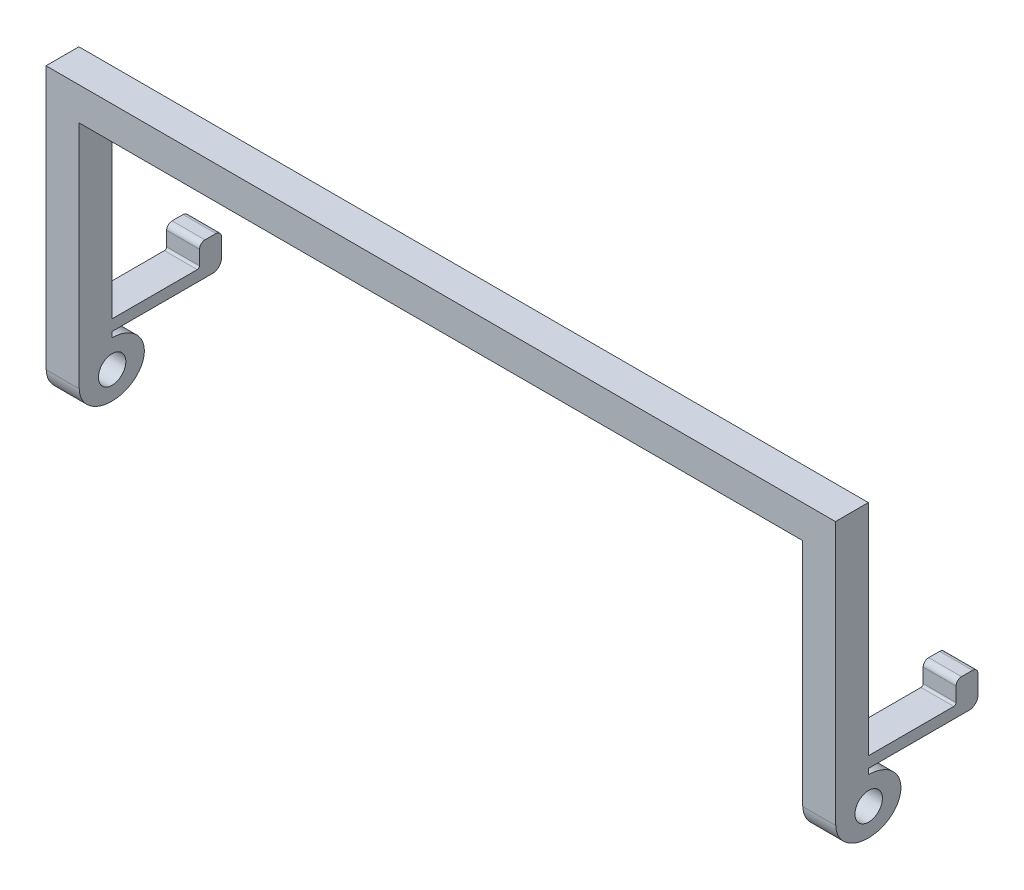
ISO-10303-21;
HEADER;
FILE_DESCRIPTION(('STEP AP214'),'2;1');
FILE_NAME('part.step','',(''),(''),'','','');
FILE_SCHEMA(('AUTOMOTIVE_DESIGN { 1 0 10303 214 1 1 1 1 }'));
ENDSEC;
DATA;
#1=APPLICATION_CONTEXT('core data for automotive mechanical design processes');
#2=APPLICATION_PROTOCOL_DEFINITION('international standard','automotive_design',2000,#1);
#3=PRODUCT_CONTEXT('',#1,'mechanical');
#4=PRODUCT('Part','Part','',(#3));
#5=PRODUCT_RELATED_PRODUCT_CATEGORY('part','',(#4));
#6=PRODUCT_DEFINITION_FORMATION('','',#4);
#7=PRODUCT_DEFINITION_CONTEXT('part definition',#1,'design');
#8=PRODUCT_DEFINITION('design','',#6,#7);
#9=PRODUCT_DEFINITION_SHAPE('','',#8);
#10=(LENGTH_UNIT() NAMED_UNIT(*) SI_UNIT(.MILLI.,.METRE.));
#11=(NAMED_UNIT(*) PLANE_ANGLE_UNIT() SI_UNIT($,.RADIAN.));
#12=(NAMED_UNIT(*) SI_UNIT($,.STERADIAN.) SOLID_ANGLE_UNIT());
#13=UNCERTAINTY_MEASURE_WITH_UNIT(LENGTH_MEASURE(1.E-05),#10,'distance_accuracy_value','');
#14=(GEOMETRIC_REPRESENTATION_CONTEXT(3) GLOBAL_UNCERTAINTY_ASSIGNED_CONTEXT((#13)) GLOBAL_UNIT_ASSIGNED_CONTEXT((#10,
#11,#12)) REPRESENTATION_CONTEXT('',''));
#15=CARTESIAN_POINT('',(0.,0.,0.));
#16=DIRECTION('',(0.,0.,1.));
#17=DIRECTION('',(1.,0.,0.));
#18=AXIS2_PLACEMENT_3D('',#15,#16,#17);
#19=CARTESIAN_POINT('',(0.,0.,3.));
#20=DIRECTION('',(0.,1.,0.));
#21=DIRECTION('',(0.,0.,1.));
#22=AXIS2_PLACEMENT_3D('',#19,#20,#21);
#23=PLANE('',#22);
#24=DIRECTION('',(0.,0.,1.));
#25=VECTOR('',#24,1.);
#26=CARTESIAN_POINT('',(-33.,0.,3.));
#27=LINE('',#26,#25);
#28=CARTESIAN_POINT('',(-33.,0.,0.));
#29=VERTEX_POINT('',#28);
#30=CARTESIAN_POINT('',(-33.,0.,3.));
#31=VERTEX_POINT('',#30);
#32=EDGE_CURVE('E51',#29,#31,#27,.T.);
#33=ORIENTED_EDGE('',*,*,#32,.F.);
#34=DIRECTION('',(1.,0.,0.));
#35=VECTOR('',#34,1.);
#36=CARTESIAN_POINT('',(0.,0.,0.));
#37=LINE('',#36,#35);
#38=CARTESIAN_POINT('',(33.,0.,0.));
#39=VERTEX_POINT('',#38);
#40=EDGE_CURVE('E251',#29,#39,#37,.T.);
#41=ORIENTED_EDGE('',*,*,#40,.T.);
#42=DIRECTION('',(0.,0.,-1.));
#43=VECTOR('',#42,1.);
#44=CARTESIAN_POINT('',(33.,0.,3.));
#45=LINE('',#44,#43);
#46=CARTESIAN_POINT('',(33.,0.,3.));
#47=VERTEX_POINT('',#46);
#48=EDGE_CURVE('E462',#47,#39,#45,.T.);
#49=ORIENTED_EDGE('',*,*,#48,.F.);
#50=DIRECTION('',(1.,0.,0.));
#51=VECTOR('',#50,1.);
#52=CARTESIAN_POINT('',(0.,0.,3.));
#53=LINE('',#52,#51);
#54=EDGE_CURVE('E47',#31,#47,#53,.T.);
#55=ORIENTED_EDGE('',*,*,#54,.F.);
#56=EDGE_LOOP('',(#33,#41,#49,#55));
#57=FACE_BOUND('',#56,.T.);
#58=ADVANCED_FACE('F32',(#57),#23,.F.);
#59=CARTESIAN_POINT('',(36.,0.,3.));
#60=DIRECTION('',(-1.,0.,0.));
#61=DIRECTION('',(0.,0.,1.));
#62=AXIS2_PLACEMENT_3D('',#59,#60,#61);
#63=PLANE('',#62);
#64=CARTESIAN_POINT('',(36.,-21.,-0.0308723752893004));
#65=DIRECTION('',(-1.,0.,0.));
#66=DIRECTION('',(0.,0.,1.));
#67=AXIS2_PLACEMENT_3D('',#64,#65,#66);
#68=CIRCLE('',#67,1.25);
#69=CARTESIAN_POINT('',(36.,-21.,1.2191276247107));
#70=VERTEX_POINT('',#69);
#71=EDGE_CURVE('E547',#70,#70,#68,.T.);
#72=ORIENTED_EDGE('',*,*,#71,.T.);
#73=EDGE_LOOP('',(#72));
#74=FACE_BOUND('',#73,.T.);
#75=DIRECTION('',(0.,1.,0.));
#76=VECTOR('',#75,1.);
#77=CARTESIAN_POINT('',(36.,0.,0.));
#78=LINE('',#77,#76);
#79=CARTESIAN_POINT('',(36.,-17.,0.));
#80=VERTEX_POINT('',#79);
#81=CARTESIAN_POINT('',(36.,3.,0.));
#82=VERTEX_POINT('',#81);
#83=EDGE_CURVE('E495',#80,#82,#78,.T.);
#84=ORIENTED_EDGE('',*,*,#83,.T.);
#85=DIRECTION('',(0.,0.,-1.));
#86=VECTOR('',#85,1.);
#87=CARTESIAN_POINT('',(36.,3.,3.));
#88=LINE('',#87,#86);
#89=CARTESIAN_POINT('',(36.,3.,3.));
#90=VERTEX_POINT('',#89);
#91=EDGE_CURVE('E11',#90,#82,#88,.T.);
#92=ORIENTED_EDGE('',*,*,#91,.F.);
#93=DIRECTION('',(0.,1.,0.));
#94=VECTOR('',#93,1.);
#95=CARTESIAN_POINT('',(36.,0.,3.));
#96=LINE('',#95,#94);
#97=CARTESIAN_POINT('',(36.,-21.,3.));
#98=VERTEX_POINT('',#97);
#99=EDGE_CURVE('E490',#98,#90,#96,.T.);
#100=ORIENTED_EDGE('',*,*,#99,.F.);
#101=DIRECTION('',(0.,0.,-1.));
#102=VECTOR('',#101,1.);
#103=CARTESIAN_POINT('',(36.,-21.,3.));
#104=LINE('',#103,#102);
#105=CARTESIAN_POINT('',(36.,-21.,2.9691276247107));
#106=VERTEX_POINT('',#105);
#107=EDGE_CURVE('E421',#98,#106,#104,.T.);
#108=ORIENTED_EDGE('',*,*,#107,.T.);
#109=CARTESIAN_POINT('',(36.,-21.,0.));
#110=DIRECTION('',(1.,0.,0.));
#111=DIRECTION('',(0.,0.,-1.));
#112=AXIS2_PLACEMENT_3D('',#109,#110,#111);
#113=ELLIPSE('',#112,2.9691276247107,2.5);
#114=CARTESIAN_POINT('',(36.,-18.5,0.));
#115=VERTEX_POINT('',#114);
#116=EDGE_CURVE('E424',#106,#115,#113,.T.);
#117=ORIENTED_EDGE('',*,*,#116,.T.);
#118=DIRECTION('',(0.,1.,0.));
#119=VECTOR('',#118,1.);
#120=CARTESIAN_POINT('',(36.,-18.,0.));
#121=LINE('',#120,#119);
#122=CARTESIAN_POINT('',(36.,-18.,0.));
#123=VERTEX_POINT('',#122);
#124=EDGE_CURVE('E428',#115,#123,#121,.T.);
#125=ORIENTED_EDGE('',*,*,#124,.T.);
#126=DIRECTION('',(0.,0.,-1.));
#127=VECTOR('',#126,1.);
#128=CARTESIAN_POINT('',(36.,-18.,-9.2));
#129=LINE('',#128,#127);
#130=CARTESIAN_POINT('',(36.,-18.,-9.2));
#131=VERTEX_POINT('',#130);
#132=EDGE_CURVE('E431',#123,#131,#129,.T.);
#133=ORIENTED_EDGE('',*,*,#132,.T.);
#134=CARTESIAN_POINT('',(36.,-17.2,-9.2));
#135=DIRECTION('',(1.,0.,0.));
#136=DIRECTION('',(0.,0.,-1.));
#137=AXIS2_PLACEMENT_3D('',#134,#135,#136);
#138=CIRCLE('',#137,0.799999999999999);
#139=CARTESIAN_POINT('',(36.,-17.2,-10.));
#140=VERTEX_POINT('',#139);
#141=EDGE_CURVE('E434',#131,#140,#138,.T.);
#142=ORIENTED_EDGE('',*,*,#141,.T.);
#143=DIRECTION('',(0.,1.,0.));
#144=VECTOR('',#143,1.);
#145=CARTESIAN_POINT('',(36.,-15.5,-10.));
#146=LINE('',#145,#144);
#147=CARTESIAN_POINT('',(36.,-15.5,-10.));
#148=VERTEX_POINT('',#147);
#149=EDGE_CURVE('E437',#140,#148,#146,.T.);
#150=ORIENTED_EDGE('',*,*,#149,.T.);
#151=CARTESIAN_POINT('',(36.,-15.5,-9.5));
#152=DIRECTION('',(1.,0.,0.));
#153=DIRECTION('',(0.,0.,1.));
#154=AXIS2_PLACEMENT_3D('',#151,#152,#153);
#155=CIRCLE('',#154,0.5);
#156=CARTESIAN_POINT('',(36.,-15.,-9.5));
#157=VERTEX_POINT('',#156);
#158=EDGE_CURVE('E440',#148,#157,#155,.T.);
#159=ORIENTED_EDGE('',*,*,#158,.T.);
#160=DIRECTION('',(0.,0.,1.));
#161=VECTOR('',#160,1.);
#162=CARTESIAN_POINT('',(36.,-15.,-8.5));
#163=LINE('',#162,#161);
#164=CARTESIAN_POINT('',(36.,-15.,-8.5));
#165=VERTEX_POINT('',#164);
#166=EDGE_CURVE('E443',#157,#165,#163,.T.);
#167=ORIENTED_EDGE('',*,*,#166,.T.);
#168=CARTESIAN_POINT('',(36.,-15.5,-8.5));
#169=DIRECTION('',(1.,0.,0.));
#170=DIRECTION('',(0.,0.,1.));
#171=AXIS2_PLACEMENT_3D('',#168,#169,#170);
#172=CIRCLE('',#171,0.5);
#173=CARTESIAN_POINT('',(36.,-15.5,-8.));
#174=VERTEX_POINT('',#173);
#175=EDGE_CURVE('E446',#165,#174,#172,.T.);
#176=ORIENTED_EDGE('',*,*,#175,.T.);
#177=DIRECTION('',(0.,-1.,0.));
#178=VECTOR('',#177,1.);
#179=CARTESIAN_POINT('',(36.,-16.8,-8.));
#180=LINE('',#179,#178);
#181=CARTESIAN_POINT('',(36.,-16.8,-8.));
#182=VERTEX_POINT('',#181);
#183=EDGE_CURVE('E449',#174,#182,#180,.T.);
#184=ORIENTED_EDGE('',*,*,#183,.T.);
#185=CARTESIAN_POINT('',(36.,-16.8,-7.8));
#186=DIRECTION('',(-1.,0.,0.));
#187=DIRECTION('',(0.,0.,-1.));
#188=AXIS2_PLACEMENT_3D('',#185,#186,#187);
#189=CIRCLE('',#188,0.199999999999999);
#190=CARTESIAN_POINT('',(36.,-17.,-7.8));
#191=VERTEX_POINT('',#190);
#192=EDGE_CURVE('E452',#182,#191,#189,.T.);
#193=ORIENTED_EDGE('',*,*,#192,.T.);
#194=DIRECTION('',(0.,0.,1.));
#195=VECTOR('',#194,1.);
#196=CARTESIAN_POINT('',(36.,-17.,0.));
#197=LINE('',#196,#195);
#198=EDGE_CURVE('E455',#191,#80,#197,.T.);
#199=ORIENTED_EDGE('',*,*,#198,.T.);
#200=EDGE_LOOP('',(#84,#92,#100,#108,#117,#125,#133,#142,#150,#159,#167,#176,#184,#193,#199));
#201=FACE_BOUND('',#200,.T.);
#202=ADVANCED_FACE('F528',(#74,#201),#63,.F.);
#203=CARTESIAN_POINT('',(0.,3.,3.));
#204=DIRECTION('',(0.,-1.,0.));
#205=DIRECTION('',(1.,0.,0.));
#206=AXIS2_PLACEMENT_3D('',#203,#204,#205);
#207=PLANE('',#206);
#208=DIRECTION('',(0.,0.,-1.));
#209=VECTOR('',#208,1.);
#210=CARTESIAN_POINT('',(-36.,3.,3.));
#211=LINE('',#210,#209);
#212=CARTESIAN_POINT('',(-36.,3.,3.));
#213=VERTEX_POINT('',#212);
#214=CARTESIAN_POINT('',(-36.,3.,0.));
#215=VERTEX_POINT('',#214);
#216=EDGE_CURVE('E425',#213,#215,#211,.T.);
#217=ORIENTED_EDGE('',*,*,#216,.F.);
#218=DIRECTION('',(-1.,0.,0.));
#219=VECTOR('',#218,1.);
#220=CARTESIAN_POINT('',(0.,3.,3.));
#221=LINE('',#220,#219);
#222=EDGE_CURVE('E40',#90,#213,#221,.T.);
#223=ORIENTED_EDGE('',*,*,#222,.F.);
#224=ORIENTED_EDGE('',*,*,#91,.T.);
#225=DIRECTION('',(-1.,0.,0.));
#226=VECTOR('',#225,1.);
#227=CARTESIAN_POINT('',(0.,3.,0.));
#228=LINE('',#227,#226);
#229=EDGE_CURVE('E491',#82,#215,#228,.T.);
#230=ORIENTED_EDGE('',*,*,#229,.T.);
#231=EDGE_LOOP('',(#217,#223,#224,#230));
#232=FACE_BOUND('',#231,.T.);
#233=ADVANCED_FACE('F501',(#232),#207,.F.);
#234=CARTESIAN_POINT('',(0.,0.,3.));
#235=DIRECTION('',(0.,0.,-1.));
#236=DIRECTION('',(-1.,0.,0.));
#237=AXIS2_PLACEMENT_3D('',#234,#235,#236);
#238=PLANE('',#237);
#239=DIRECTION('',(0.,1.,0.));
#240=VECTOR('',#239,1.);
#241=CARTESIAN_POINT('',(-36.,0.,3.));
#242=LINE('',#241,#240);
#243=CARTESIAN_POINT('',(-36.,-21.,3.));
#244=VERTEX_POINT('',#243);
#245=EDGE_CURVE('E508',#244,#213,#242,.T.);
#246=ORIENTED_EDGE('',*,*,#245,.F.);
#247=DIRECTION('',(-1.,0.,0.));
#248=VECTOR('',#247,1.);
#249=CARTESIAN_POINT('',(-33.,-21.,3.));
#250=LINE('',#249,#248);
#251=CARTESIAN_POINT('',(-33.,-21.,3.));
#252=VERTEX_POINT('',#251);
#253=EDGE_CURVE('E512',#252,#244,#250,.T.);
#254=ORIENTED_EDGE('',*,*,#253,.F.);
#255=DIRECTION('',(0.,-1.,0.));
#256=VECTOR('',#255,1.);
#257=CARTESIAN_POINT('',(-33.,3.,3.));
#258=LINE('',#257,#256);
#259=EDGE_CURVE('E252',#31,#252,#258,.T.);
#260=ORIENTED_EDGE('',*,*,#259,.F.);
#261=ORIENTED_EDGE('',*,*,#54,.T.);
#262=DIRECTION('',(0.,-1.,0.));
#263=VECTOR('',#262,1.);
#264=CARTESIAN_POINT('',(33.,3.,3.));
#265=LINE('',#264,#263);
#266=CARTESIAN_POINT('',(33.,-21.,3.));
#267=VERTEX_POINT('',#266);
#268=EDGE_CURVE('E458',#47,#267,#265,.T.);
#269=ORIENTED_EDGE('',*,*,#268,.T.);
#270=DIRECTION('',(1.,0.,0.));
#271=VECTOR('',#270,1.);
#272=CARTESIAN_POINT('',(33.,-21.,3.));
#273=LINE('',#272,#271);
#274=EDGE_CURVE('E420',#267,#98,#273,.T.);
#275=ORIENTED_EDGE('',*,*,#274,.T.);
#276=ORIENTED_EDGE('',*,*,#99,.T.);
#277=ORIENTED_EDGE('',*,*,#222,.T.);
#278=EDGE_LOOP('',(#246,#254,#260,#261,#269,#275,#276,#277));
#279=FACE_BOUND('',#278,.T.);
#280=ADVANCED_FACE('F529',(#279),#238,.F.);
#281=CARTESIAN_POINT('',(0.,0.,0.));
#282=DIRECTION('',(0.,0.,-1.));
#283=DIRECTION('',(-1.,0.,0.));
#284=AXIS2_PLACEMENT_3D('',#281,#282,#283);
#285=PLANE('',#284);
#286=DIRECTION('',(0.,1.,0.));
#287=VECTOR('',#286,1.);
#288=CARTESIAN_POINT('',(-36.,0.,0.));
#289=LINE('',#288,#287);
#290=CARTESIAN_POINT('',(-36.,-17.,0.));
#291=VERTEX_POINT('',#290);
#292=EDGE_CURVE('E506',#291,#215,#289,.T.);
#293=ORIENTED_EDGE('',*,*,#292,.T.);
#294=ORIENTED_EDGE('',*,*,#229,.F.);
#295=ORIENTED_EDGE('',*,*,#83,.F.);
#296=DIRECTION('',(1.,0.,0.));
#297=VECTOR('',#296,1.);
#298=CARTESIAN_POINT('',(33.,-17.,0.));
#299=LINE('',#298,#297);
#300=CARTESIAN_POINT('',(33.,-17.,0.));
#301=VERTEX_POINT('',#300);
#302=EDGE_CURVE('E459',#301,#80,#299,.T.);
#303=ORIENTED_EDGE('',*,*,#302,.F.);
#304=DIRECTION('',(0.,1.,0.));
#305=VECTOR('',#304,1.);
#306=CARTESIAN_POINT('',(33.,3.,0.));
#307=LINE('',#306,#305);
#308=EDGE_CURVE('E418',#301,#39,#307,.T.);
#309=ORIENTED_EDGE('',*,*,#308,.T.);
#310=ORIENTED_EDGE('',*,*,#40,.F.);
#311=DIRECTION('',(0.,1.,0.));
#312=VECTOR('',#311,1.);
#313=CARTESIAN_POINT('',(-33.,3.,0.));
#314=LINE('',#313,#312);
#315=CARTESIAN_POINT('',(-33.,-17.,0.));
#316=VERTEX_POINT('',#315);
#317=EDGE_CURVE('E231',#316,#29,#314,.T.);
#318=ORIENTED_EDGE('',*,*,#317,.F.);
#319=DIRECTION('',(-1.,0.,0.));
#320=VECTOR('',#319,1.);
#321=CARTESIAN_POINT('',(-33.,-17.,0.));
#322=LINE('',#321,#320);
#323=EDGE_CURVE('E240',#316,#291,#322,.T.);
#324=ORIENTED_EDGE('',*,*,#323,.T.);
#325=EDGE_LOOP('',(#293,#294,#295,#303,#309,#310,#318,#324));
#326=FACE_BOUND('',#325,.T.);
#327=ADVANCED_FACE('F249',(#326),#285,.T.);
#328=CARTESIAN_POINT('',(33.,-21.,0.));
#329=DIRECTION('',(1.,0.,0.));
#330=DIRECTION('',(0.,0.,-1.));
#331=AXIS2_PLACEMENT_3D('',#328,#329,#330);
#332=PLANE('',#331);
#333=CARTESIAN_POINT('',(33.,-21.,-0.0308723752893004));
#334=DIRECTION('',(1.,0.,0.));
#335=DIRECTION('',(0.,0.,-1.));
#336=AXIS2_PLACEMENT_3D('',#333,#334,#335);
#337=CIRCLE('',#336,1.25);
#338=CARTESIAN_POINT('',(33.,-21.,-1.2808723752893));
#339=VERTEX_POINT('',#338);
#340=EDGE_CURVE('E549',#339,#339,#337,.T.);
#341=ORIENTED_EDGE('',*,*,#340,.T.);
#342=EDGE_LOOP('',(#341));
#343=FACE_BOUND('',#342,.T.);
#344=ORIENTED_EDGE('',*,*,#268,.F.);
#345=ORIENTED_EDGE('',*,*,#48,.T.);
#346=ORIENTED_EDGE('',*,*,#308,.F.);
#347=DIRECTION('',(0.,0.,1.));
#348=VECTOR('',#347,1.);
#349=CARTESIAN_POINT('',(33.,-17.,0.));
#350=LINE('',#349,#348);
#351=CARTESIAN_POINT('',(33.,-17.,-7.8));
#352=VERTEX_POINT('',#351);
#353=EDGE_CURVE('E415',#352,#301,#350,.T.);
#354=ORIENTED_EDGE('',*,*,#353,.F.);
#355=CARTESIAN_POINT('',(33.,-16.8,-7.8));
#356=DIRECTION('',(-1.,0.,0.));
#357=DIRECTION('',(0.,0.,-1.));
#358=AXIS2_PLACEMENT_3D('',#355,#356,#357);
#359=CIRCLE('',#358,0.199999999999999);
#360=CARTESIAN_POINT('',(33.,-16.8,-8.));
#361=VERTEX_POINT('',#360);
#362=EDGE_CURVE('E412',#361,#352,#359,.T.);
#363=ORIENTED_EDGE('',*,*,#362,.F.);
#364=DIRECTION('',(0.,-1.,0.));
#365=VECTOR('',#364,1.);
#366=CARTESIAN_POINT('',(33.,-16.8,-8.));
#367=LINE('',#366,#365);
#368=CARTESIAN_POINT('',(33.,-15.5,-8.));
#369=VERTEX_POINT('',#368);
#370=EDGE_CURVE('E409',#369,#361,#367,.T.);
#371=ORIENTED_EDGE('',*,*,#370,.F.);
#372=CARTESIAN_POINT('',(33.,-15.5,-8.5));
#373=DIRECTION('',(1.,0.,0.));
#374=DIRECTION('',(0.,0.,1.));
#375=AXIS2_PLACEMENT_3D('',#372,#373,#374);
#376=CIRCLE('',#375,0.5);
#377=CARTESIAN_POINT('',(33.,-15.,-8.5));
#378=VERTEX_POINT('',#377);
#379=EDGE_CURVE('E406',#378,#369,#376,.T.);
#380=ORIENTED_EDGE('',*,*,#379,.F.);
#381=DIRECTION('',(0.,0.,1.));
#382=VECTOR('',#381,1.);
#383=CARTESIAN_POINT('',(33.,-15.,-8.5));
#384=LINE('',#383,#382);
#385=CARTESIAN_POINT('',(33.,-15.,-9.5));
#386=VERTEX_POINT('',#385);
#387=EDGE_CURVE('E403',#386,#378,#384,.T.);
#388=ORIENTED_EDGE('',*,*,#387,.F.);
#389=CARTESIAN_POINT('',(33.,-15.5,-9.5));
#390=DIRECTION('',(1.,0.,0.));
#391=DIRECTION('',(0.,0.,1.));
#392=AXIS2_PLACEMENT_3D('',#389,#390,#391);
#393=CIRCLE('',#392,0.5);
#394=CARTESIAN_POINT('',(33.,-15.5,-10.));
#395=VERTEX_POINT('',#394);
#396=EDGE_CURVE('E400',#395,#386,#393,.T.);
#397=ORIENTED_EDGE('',*,*,#396,.F.);
#398=DIRECTION('',(0.,1.,0.));
#399=VECTOR('',#398,1.);
#400=CARTESIAN_POINT('',(33.,-15.5,-10.));
#401=LINE('',#400,#399);
#402=CARTESIAN_POINT('',(33.,-17.2,-10.));
#403=VERTEX_POINT('',#402);
#404=EDGE_CURVE('E397',#403,#395,#401,.T.);
#405=ORIENTED_EDGE('',*,*,#404,.F.);
#406=CARTESIAN_POINT('',(33.,-17.2,-9.2));
#407=DIRECTION('',(1.,0.,0.));
#408=DIRECTION('',(0.,0.,-1.));
#409=AXIS2_PLACEMENT_3D('',#406,#407,#408);
#410=CIRCLE('',#409,0.799999999999999);
#411=CARTESIAN_POINT('',(33.,-18.,-9.2));
#412=VERTEX_POINT('',#411);
#413=EDGE_CURVE('E394',#412,#403,#410,.T.);
#414=ORIENTED_EDGE('',*,*,#413,.F.);
#415=DIRECTION('',(0.,0.,-1.));
#416=VECTOR('',#415,1.);
#417=CARTESIAN_POINT('',(33.,-18.,-9.2));
#418=LINE('',#417,#416);
#419=CARTESIAN_POINT('',(33.,-18.,0.));
#420=VERTEX_POINT('',#419);
#421=EDGE_CURVE('E391',#420,#412,#418,.T.);
#422=ORIENTED_EDGE('',*,*,#421,.F.);
#423=DIRECTION('',(0.,1.,0.));
#424=VECTOR('',#423,1.);
#425=CARTESIAN_POINT('',(33.,-18.,0.));
#426=LINE('',#425,#424);
#427=CARTESIAN_POINT('',(33.,-18.5,0.));
#428=VERTEX_POINT('',#427);
#429=EDGE_CURVE('E386',#428,#420,#426,.T.);
#430=ORIENTED_EDGE('',*,*,#429,.F.);
#431=CARTESIAN_POINT('',(33.,-21.,0.));
#432=DIRECTION('',(1.,0.,0.));
#433=DIRECTION('',(0.,0.,-1.));
#434=AXIS2_PLACEMENT_3D('',#431,#432,#433);
#435=ELLIPSE('',#434,2.9691276247107,2.5);
#436=CARTESIAN_POINT('',(33.,-21.,2.9691276247107));
#437=VERTEX_POINT('',#436);
#438=EDGE_CURVE('E381',#437,#428,#435,.T.);
#439=ORIENTED_EDGE('',*,*,#438,.F.);
#440=DIRECTION('',(0.,0.,-1.));
#441=VECTOR('',#440,1.);
#442=CARTESIAN_POINT('',(33.,-21.,3.));
#443=LINE('',#442,#441);
#444=EDGE_CURVE('E387',#267,#437,#443,.T.);
#445=ORIENTED_EDGE('',*,*,#444,.F.);
#446=EDGE_LOOP('',(#344,#345,#346,#354,#363,#371,#380,#388,#397,#405,#414,#422,#430,#439,#445));
#447=FACE_BOUND('',#446,.T.);
#448=ADVANCED_FACE('F331',(#343,#447),#332,.F.);
#449=CARTESIAN_POINT('',(33.,-17.,0.));
#450=DIRECTION('',(0.,1.,0.));
#451=DIRECTION('',(0.,0.,1.));
#452=AXIS2_PLACEMENT_3D('',#449,#450,#451);
#453=PLANE('',#452);
#454=ORIENTED_EDGE('',*,*,#198,.F.);
#455=DIRECTION('',(1.,0.,0.));
#456=VECTOR('',#455,1.);
#457=CARTESIAN_POINT('',(33.,-17.,-7.8));
#458=LINE('',#457,#456);
#459=EDGE_CURVE('E463',#352,#191,#458,.T.);
#460=ORIENTED_EDGE('',*,*,#459,.F.);
#461=ORIENTED_EDGE('',*,*,#353,.T.);
#462=ORIENTED_EDGE('',*,*,#302,.T.);
#463=EDGE_LOOP('',(#454,#460,#461,#462));
#464=FACE_BOUND('',#463,.T.);
#465=ADVANCED_FACE('F334',(#464),#453,.T.);
#466=CARTESIAN_POINT('',(33.,-16.8,-7.8));
#467=DIRECTION('',(1.,0.,0.));
#468=DIRECTION('',(0.,0.,-1.));
#469=AXIS2_PLACEMENT_3D('',#466,#467,#468);
#470=CYLINDRICAL_SURFACE('',#469,0.199999999999999);
#471=ORIENTED_EDGE('',*,*,#192,.F.);
#472=DIRECTION('',(1.,0.,0.));
#473=VECTOR('',#472,1.);
#474=CARTESIAN_POINT('',(33.,-16.8,-8.));
#475=LINE('',#474,#473);
#476=EDGE_CURVE('E465',#361,#182,#475,.T.);
#477=ORIENTED_EDGE('',*,*,#476,.F.);
#478=ORIENTED_EDGE('',*,*,#362,.T.);
#479=ORIENTED_EDGE('',*,*,#459,.T.);
#480=EDGE_LOOP('',(#471,#477,#478,#479));
#481=FACE_BOUND('',#480,.T.);
#482=ADVANCED_FACE('F338',(#481),#470,.F.);
#483=CARTESIAN_POINT('',(33.,-16.8,-8.));
#484=DIRECTION('',(0.,0.,1.));
#485=DIRECTION('',(1.,0.,0.));
#486=AXIS2_PLACEMENT_3D('',#483,#484,#485);
#487=PLANE('',#486);
#488=ORIENTED_EDGE('',*,*,#183,.F.);
#489=DIRECTION('',(1.,0.,0.));
#490=VECTOR('',#489,1.);
#491=CARTESIAN_POINT('',(33.,-15.5,-8.));
#492=LINE('',#491,#490);
#493=EDGE_CURVE('E467',#369,#174,#492,.T.);
#494=ORIENTED_EDGE('',*,*,#493,.F.);
#495=ORIENTED_EDGE('',*,*,#370,.T.);
#496=ORIENTED_EDGE('',*,*,#476,.T.);
#497=EDGE_LOOP('',(#488,#494,#495,#496));
#498=FACE_BOUND('',#497,.T.);
#499=ADVANCED_FACE('F342',(#498),#487,.T.);
#500=CARTESIAN_POINT('',(33.,-15.5,-8.5));
#501=DIRECTION('',(1.,0.,0.));
#502=DIRECTION('',(0.,0.,-1.));
#503=AXIS2_PLACEMENT_3D('',#500,#501,#502);
#504=CYLINDRICAL_SURFACE('',#503,0.5);
#505=ORIENTED_EDGE('',*,*,#175,.F.);
#506=DIRECTION('',(1.,0.,0.));
#507=VECTOR('',#506,1.);
#508=CARTESIAN_POINT('',(33.,-15.,-8.5));
#509=LINE('',#508,#507);
#510=EDGE_CURVE('E469',#378,#165,#509,.T.);
#511=ORIENTED_EDGE('',*,*,#510,.F.);
#512=ORIENTED_EDGE('',*,*,#379,.T.);
#513=ORIENTED_EDGE('',*,*,#493,.T.);
#514=EDGE_LOOP('',(#505,#511,#512,#513));
#515=FACE_BOUND('',#514,.T.);
#516=ADVANCED_FACE('F346',(#515),#504,.T.);
#517=CARTESIAN_POINT('',(33.,-15.,-8.5));
#518=DIRECTION('',(0.,1.,0.));
#519=DIRECTION('',(0.,0.,1.));
#520=AXIS2_PLACEMENT_3D('',#517,#518,#519);
#521=PLANE('',#520);
#522=ORIENTED_EDGE('',*,*,#166,.F.);
#523=DIRECTION('',(1.,0.,0.));
#524=VECTOR('',#523,1.);
#525=CARTESIAN_POINT('',(33.,-15.,-9.5));
#526=LINE('',#525,#524);
#527=EDGE_CURVE('E471',#386,#157,#526,.T.);
#528=ORIENTED_EDGE('',*,*,#527,.F.);
#529=ORIENTED_EDGE('',*,*,#387,.T.);
#530=ORIENTED_EDGE('',*,*,#510,.T.);
#531=EDGE_LOOP('',(#522,#528,#529,#530));
#532=FACE_BOUND('',#531,.T.);
#533=ADVANCED_FACE('F350',(#532),#521,.T.);
#534=CARTESIAN_POINT('',(33.,-15.5,-9.5));
#535=DIRECTION('',(1.,0.,0.));
#536=DIRECTION('',(0.,0.,-1.));
#537=AXIS2_PLACEMENT_3D('',#534,#535,#536);
#538=CYLINDRICAL_SURFACE('',#537,0.5);
#539=ORIENTED_EDGE('',*,*,#158,.F.);
#540=DIRECTION('',(1.,0.,0.));
#541=VECTOR('',#540,1.);
#542=CARTESIAN_POINT('',(33.,-15.5,-10.));
#543=LINE('',#542,#541);
#544=EDGE_CURVE('E473',#395,#148,#543,.T.);
#545=ORIENTED_EDGE('',*,*,#544,.F.);
#546=ORIENTED_EDGE('',*,*,#396,.T.);
#547=ORIENTED_EDGE('',*,*,#527,.T.);
#548=EDGE_LOOP('',(#539,#545,#546,#547));
#549=FACE_BOUND('',#548,.T.);
#550=ADVANCED_FACE('F354',(#549),#538,.T.);
#551=CARTESIAN_POINT('',(33.,-15.5,-10.));
#552=DIRECTION('',(0.,0.,-1.));
#553=DIRECTION('',(-1.,0.,0.));
#554=AXIS2_PLACEMENT_3D('',#551,#552,#553);
#555=PLANE('',#554);
#556=ORIENTED_EDGE('',*,*,#149,.F.);
#557=DIRECTION('',(1.,0.,0.));
#558=VECTOR('',#557,1.);
#559=CARTESIAN_POINT('',(33.,-17.2,-10.));
#560=LINE('',#559,#558);
#561=EDGE_CURVE('E475',#403,#140,#560,.T.);
#562=ORIENTED_EDGE('',*,*,#561,.F.);
#563=ORIENTED_EDGE('',*,*,#404,.T.);
#564=ORIENTED_EDGE('',*,*,#544,.T.);
#565=EDGE_LOOP('',(#556,#562,#563,#564));
#566=FACE_BOUND('',#565,.T.);
#567=ADVANCED_FACE('F358',(#566),#555,.T.);
#568=CARTESIAN_POINT('',(33.,-17.2,-9.2));
#569=DIRECTION('',(1.,0.,0.));
#570=DIRECTION('',(0.,0.,-1.));
#571=AXIS2_PLACEMENT_3D('',#568,#569,#570);
#572=CYLINDRICAL_SURFACE('',#571,0.799999999999999);
#573=ORIENTED_EDGE('',*,*,#141,.F.);
#574=DIRECTION('',(1.,0.,0.));
#575=VECTOR('',#574,1.);
#576=CARTESIAN_POINT('',(33.,-18.,-9.2));
#577=LINE('',#576,#575);
#578=EDGE_CURVE('E477',#412,#131,#577,.T.);
#579=ORIENTED_EDGE('',*,*,#578,.F.);
#580=ORIENTED_EDGE('',*,*,#413,.T.);
#581=ORIENTED_EDGE('',*,*,#561,.T.);
#582=EDGE_LOOP('',(#573,#579,#580,#581));
#583=FACE_BOUND('',#582,.T.);
#584=ADVANCED_FACE('F362',(#583),#572,.T.);
#585=CARTESIAN_POINT('',(33.,-18.,-9.2));
#586=DIRECTION('',(0.,-1.,0.));
#587=DIRECTION('',(0.,0.,-1.));
#588=AXIS2_PLACEMENT_3D('',#585,#586,#587);
#589=PLANE('',#588);
#590=ORIENTED_EDGE('',*,*,#132,.F.);
#591=DIRECTION('',(1.,0.,0.));
#592=VECTOR('',#591,1.);
#593=CARTESIAN_POINT('',(33.,-18.,0.));
#594=LINE('',#593,#592);
#595=EDGE_CURVE('E479',#420,#123,#594,.T.);
#596=ORIENTED_EDGE('',*,*,#595,.F.);
#597=ORIENTED_EDGE('',*,*,#421,.T.);
#598=ORIENTED_EDGE('',*,*,#578,.T.);
#599=EDGE_LOOP('',(#590,#596,#597,#598));
#600=FACE_BOUND('',#599,.T.);
#601=ADVANCED_FACE('F366',(#600),#589,.T.);
#602=CARTESIAN_POINT('',(33.,-18.,0.));
#603=DIRECTION('',(0.,0.,-1.));
#604=DIRECTION('',(0.,1.,0.));
#605=AXIS2_PLACEMENT_3D('',#602,#603,#604);
#606=PLANE('',#605);
#607=ORIENTED_EDGE('',*,*,#124,.F.);
#608=DIRECTION('',(1.,0.,0.));
#609=VECTOR('',#608,1.);
#610=CARTESIAN_POINT('',(33.,-18.5,0.));
#611=LINE('',#610,#609);
#612=EDGE_CURVE('E481',#428,#115,#611,.T.);
#613=ORIENTED_EDGE('',*,*,#612,.F.);
#614=ORIENTED_EDGE('',*,*,#429,.T.);
#615=ORIENTED_EDGE('',*,*,#595,.T.);
#616=EDGE_LOOP('',(#607,#613,#614,#615));
#617=FACE_BOUND('',#616,.T.);
#618=ADVANCED_FACE('F370',(#617),#606,.T.);
#619=DIRECTION('',(1.,0.,0.));
#620=VECTOR('',#619,1.);
#621=SURFACE_OF_LINEAR_EXTRUSION('',#435,#620);
#622=ORIENTED_EDGE('',*,*,#116,.F.);
#623=DIRECTION('',(1.,0.,0.));
#624=VECTOR('',#623,1.);
#625=CARTESIAN_POINT('',(33.,-21.,2.9691276247107));
#626=LINE('',#625,#624);
#627=EDGE_CURVE('E483',#437,#106,#626,.T.);
#628=ORIENTED_EDGE('',*,*,#627,.F.);
#629=ORIENTED_EDGE('',*,*,#438,.T.);
#630=ORIENTED_EDGE('',*,*,#612,.T.);
#631=EDGE_LOOP('',(#622,#628,#629,#630));
#632=FACE_BOUND('',#631,.T.);
#633=ADVANCED_FACE('F374',(#632),#621,.T.);
#634=CARTESIAN_POINT('',(33.,-21.,3.));
#635=DIRECTION('',(0.,-1.,0.));
#636=DIRECTION('',(0.,0.,-1.));
#637=AXIS2_PLACEMENT_3D('',#634,#635,#636);
#638=PLANE('',#637);
#639=ORIENTED_EDGE('',*,*,#107,.F.);
#640=ORIENTED_EDGE('',*,*,#274,.F.);
#641=ORIENTED_EDGE('',*,*,#444,.T.);
#642=ORIENTED_EDGE('',*,*,#627,.T.);
#643=EDGE_LOOP('',(#639,#640,#641,#642));
#644=FACE_BOUND('',#643,.T.);
#645=ADVANCED_FACE('F329',(#644),#638,.T.);
#646=CARTESIAN_POINT('',(-36.,0.,3.));
#647=DIRECTION('',(-1.,0.,0.));
#648=DIRECTION('',(0.,0.,1.));
#649=AXIS2_PLACEMENT_3D('',#646,#647,#648);
#650=PLANE('',#649);
#651=CARTESIAN_POINT('',(-36.,-21.,-0.0308723752893004));
#652=DIRECTION('',(1.,0.,0.));
#653=DIRECTION('',(0.,0.,-1.));
#654=AXIS2_PLACEMENT_3D('',#651,#652,#653);
#655=CIRCLE('',#654,1.25);
#656=CARTESIAN_POINT('',(-36.,-21.,-1.2808723752893));
#657=VERTEX_POINT('',#656);
#658=EDGE_CURVE('E554',#657,#657,#655,.T.);
#659=ORIENTED_EDGE('',*,*,#658,.T.);
#660=EDGE_LOOP('',(#659));
#661=FACE_BOUND('',#660,.T.);
#662=ORIENTED_EDGE('',*,*,#292,.F.);
#663=DIRECTION('',(0.,0.,1.));
#664=VECTOR('',#663,1.);
#665=CARTESIAN_POINT('',(-36.,-17.,0.));
#666=LINE('',#665,#664);
#667=CARTESIAN_POINT('',(-36.,-17.,-7.8));
#668=VERTEX_POINT('',#667);
#669=EDGE_CURVE('E243',#668,#291,#666,.T.);
#670=ORIENTED_EDGE('',*,*,#669,.F.);
#671=CARTESIAN_POINT('',(-36.,-16.8,-7.8));
#672=DIRECTION('',(-1.,0.,0.));
#673=DIRECTION('',(0.,0.,-1.));
#674=AXIS2_PLACEMENT_3D('',#671,#672,#673);
#675=CIRCLE('',#674,0.199999999999999);
#676=CARTESIAN_POINT('',(-36.,-16.8,-8.));
#677=VERTEX_POINT('',#676);
#678=EDGE_CURVE('E550',#677,#668,#675,.T.);
#679=ORIENTED_EDGE('',*,*,#678,.F.);
#680=DIRECTION('',(0.,-1.,0.));
#681=VECTOR('',#680,1.);
#682=CARTESIAN_POINT('',(-36.,-16.8,-8.));
#683=LINE('',#682,#681);
#684=CARTESIAN_POINT('',(-36.,-15.5,-8.));
#685=VERTEX_POINT('',#684);
#686=EDGE_CURVE('E626',#685,#677,#683,.T.);
#687=ORIENTED_EDGE('',*,*,#686,.F.);
#688=CARTESIAN_POINT('',(-36.,-15.5,-8.5));
#689=DIRECTION('',(1.,0.,0.));
#690=DIRECTION('',(0.,0.,1.));
#691=AXIS2_PLACEMENT_3D('',#688,#689,#690);
#692=CIRCLE('',#691,0.5);
#693=CARTESIAN_POINT('',(-36.,-15.,-8.5));
#694=VERTEX_POINT('',#693);
#695=EDGE_CURVE('E628',#694,#685,#692,.T.);
#696=ORIENTED_EDGE('',*,*,#695,.F.);
#697=DIRECTION('',(0.,0.,1.));
#698=VECTOR('',#697,1.);
#699=CARTESIAN_POINT('',(-36.,-15.,-8.5));
#700=LINE('',#699,#698);
#701=CARTESIAN_POINT('',(-36.,-15.,-9.5));
#702=VERTEX_POINT('',#701);
#703=EDGE_CURVE('E632',#702,#694,#700,.T.);
#704=ORIENTED_EDGE('',*,*,#703,.F.);
#705=CARTESIAN_POINT('',(-36.,-15.5,-9.5));
#706=DIRECTION('',(1.,0.,0.));
#707=DIRECTION('',(0.,0.,1.));
#708=AXIS2_PLACEMENT_3D('',#705,#706,#707);
#709=CIRCLE('',#708,0.5);
#710=CARTESIAN_POINT('',(-36.,-15.5,-10.));
#711=VERTEX_POINT('',#710);
#712=EDGE_CURVE('E634',#711,#702,#709,.T.);
#713=ORIENTED_EDGE('',*,*,#712,.F.);
#714=DIRECTION('',(0.,1.,0.));
#715=VECTOR('',#714,1.);
#716=CARTESIAN_POINT('',(-36.,-15.5,-10.));
#717=LINE('',#716,#715);
#718=CARTESIAN_POINT('',(-36.,-17.2,-10.));
#719=VERTEX_POINT('',#718);
#720=EDGE_CURVE('E636',#719,#711,#717,.T.);
#721=ORIENTED_EDGE('',*,*,#720,.F.);
#722=CARTESIAN_POINT('',(-36.,-17.2,-9.2));
#723=DIRECTION('',(1.,0.,0.));
#724=DIRECTION('',(0.,0.,-1.));
#725=AXIS2_PLACEMENT_3D('',#722,#723,#724);
#726=CIRCLE('',#725,0.799999999999999);
#727=CARTESIAN_POINT('',(-36.,-18.,-9.2));
#728=VERTEX_POINT('',#727);
#729=EDGE_CURVE('E638',#728,#719,#726,.T.);
#730=ORIENTED_EDGE('',*,*,#729,.F.);
#731=DIRECTION('',(0.,0.,-1.));
#732=VECTOR('',#731,1.);
#733=CARTESIAN_POINT('',(-36.,-18.,-9.2));
#734=LINE('',#733,#732);
#735=CARTESIAN_POINT('',(-36.,-18.,0.));
#736=VERTEX_POINT('',#735);
#737=EDGE_CURVE('E593',#736,#728,#734,.T.);
#738=ORIENTED_EDGE('',*,*,#737,.F.);
#739=DIRECTION('',(0.,1.,0.));
#740=VECTOR('',#739,1.);
#741=CARTESIAN_POINT('',(-36.,-18.,0.));
#742=LINE('',#741,#740);
#743=CARTESIAN_POINT('',(-36.,-18.5,0.));
#744=VERTEX_POINT('',#743);
#745=EDGE_CURVE('E591',#744,#736,#742,.T.);
#746=ORIENTED_EDGE('',*,*,#745,.F.);
#747=CARTESIAN_POINT('',(-36.,-21.,0.));
#748=DIRECTION('',(1.,0.,0.));
#749=DIRECTION('',(0.,0.,-1.));
#750=AXIS2_PLACEMENT_3D('',#747,#748,#749);
#751=ELLIPSE('',#750,2.9691276247107,2.5);
#752=CARTESIAN_POINT('',(-36.,-21.,2.9691276247107));
#753=VERTEX_POINT('',#752);
#754=EDGE_CURVE('E583',#753,#744,#751,.T.);
#755=ORIENTED_EDGE('',*,*,#754,.F.);
#756=DIRECTION('',(0.,0.,-1.));
#757=VECTOR('',#756,1.);
#758=CARTESIAN_POINT('',(-36.,-21.,3.));
#759=LINE('',#758,#757);
#760=EDGE_CURVE('E254',#244,#753,#759,.T.);
#761=ORIENTED_EDGE('',*,*,#760,.F.);
#762=ORIENTED_EDGE('',*,*,#245,.T.);
#763=ORIENTED_EDGE('',*,*,#216,.T.);
#764=EDGE_LOOP('',(#662,#670,#679,#687,#696,#704,#713,#721,#730,#738,#746,#755,#761,#762,#763));
#765=FACE_BOUND('',#764,.T.);
#766=ADVANCED_FACE('F326',(#661,#765),#650,.T.);
#767=CARTESIAN_POINT('',(-33.,-21.,0.));
#768=DIRECTION('',(-1.,0.,0.));
#769=DIRECTION('',(0.,0.,-1.));
#770=AXIS2_PLACEMENT_3D('',#767,#768,#769);
#771=PLANE('',#770);
#772=CARTESIAN_POINT('',(-33.,-21.,-0.0308723752893004));
#773=DIRECTION('',(-1.,0.,0.));
#774=DIRECTION('',(0.,0.,1.));
#775=AXIS2_PLACEMENT_3D('',#772,#773,#774);
#776=CIRCLE('',#775,1.25);
#777=CARTESIAN_POINT('',(-33.,-21.,1.2191276247107));
#778=VERTEX_POINT('',#777);
#779=EDGE_CURVE('E35',#778,#778,#776,.T.);
#780=ORIENTED_EDGE('',*,*,#779,.T.);
#781=EDGE_LOOP('',(#780));
#782=FACE_BOUND('',#781,.T.);
#783=ORIENTED_EDGE('',*,*,#317,.T.);
#784=ORIENTED_EDGE('',*,*,#32,.T.);
#785=ORIENTED_EDGE('',*,*,#259,.T.);
#786=DIRECTION('',(0.,0.,-1.));
#787=VECTOR('',#786,1.);
#788=CARTESIAN_POINT('',(-33.,-21.,3.));
#789=LINE('',#788,#787);
#790=CARTESIAN_POINT('',(-33.,-21.,2.9691276247107));
#791=VERTEX_POINT('',#790);
#792=EDGE_CURVE('E247',#252,#791,#789,.T.);
#793=ORIENTED_EDGE('',*,*,#792,.T.);
#794=CARTESIAN_POINT('',(-33.,-21.,0.));
#795=DIRECTION('',(1.,0.,0.));
#796=DIRECTION('',(0.,0.,-1.));
#797=AXIS2_PLACEMENT_3D('',#794,#795,#796);
#798=ELLIPSE('',#797,2.9691276247107,2.5);
#799=CARTESIAN_POINT('',(-33.,-18.5,0.));
#800=VERTEX_POINT('',#799);
#801=EDGE_CURVE('E275',#791,#800,#798,.T.);
#802=ORIENTED_EDGE('',*,*,#801,.T.);
#803=DIRECTION('',(0.,1.,0.));
#804=VECTOR('',#803,1.);
#805=CARTESIAN_POINT('',(-33.,-18.,0.));
#806=LINE('',#805,#804);
#807=CARTESIAN_POINT('',(-33.,-18.,0.));
#808=VERTEX_POINT('',#807);
#809=EDGE_CURVE('E273',#800,#808,#806,.T.);
#810=ORIENTED_EDGE('',*,*,#809,.T.);
#811=DIRECTION('',(0.,0.,-1.));
#812=VECTOR('',#811,1.);
#813=CARTESIAN_POINT('',(-33.,-18.,-9.2));
#814=LINE('',#813,#812);
#815=CARTESIAN_POINT('',(-33.,-18.,-9.2));
#816=VERTEX_POINT('',#815);
#817=EDGE_CURVE('E271',#808,#816,#814,.T.);
#818=ORIENTED_EDGE('',*,*,#817,.T.);
#819=CARTESIAN_POINT('',(-33.,-17.2,-9.2));
#820=DIRECTION('',(1.,0.,0.));
#821=DIRECTION('',(0.,0.,-1.));
#822=AXIS2_PLACEMENT_3D('',#819,#820,#821);
#823=CIRCLE('',#822,0.799999999999999);
#824=CARTESIAN_POINT('',(-33.,-17.2,-10.));
#825=VERTEX_POINT('',#824);
#826=EDGE_CURVE('E269',#816,#825,#823,.T.);
#827=ORIENTED_EDGE('',*,*,#826,.T.);
#828=DIRECTION('',(0.,1.,0.));
#829=VECTOR('',#828,1.);
#830=CARTESIAN_POINT('',(-33.,-15.5,-10.));
#831=LINE('',#830,#829);
#832=CARTESIAN_POINT('',(-33.,-15.5,-10.));
#833=VERTEX_POINT('',#832);
#834=EDGE_CURVE('E267',#825,#833,#831,.T.);
#835=ORIENTED_EDGE('',*,*,#834,.T.);
#836=CARTESIAN_POINT('',(-33.,-15.5,-9.5));
#837=DIRECTION('',(1.,0.,0.));
#838=DIRECTION('',(0.,0.,1.));
#839=AXIS2_PLACEMENT_3D('',#836,#837,#838);
#840=CIRCLE('',#839,0.5);
#841=CARTESIAN_POINT('',(-33.,-15.,-9.5));
#842=VERTEX_POINT('',#841);
#843=EDGE_CURVE('E265',#833,#842,#840,.T.);
#844=ORIENTED_EDGE('',*,*,#843,.T.);
#845=DIRECTION('',(0.,0.,1.));
#846=VECTOR('',#845,1.);
#847=CARTESIAN_POINT('',(-33.,-15.,-8.5));
#848=LINE('',#847,#846);
#849=CARTESIAN_POINT('',(-33.,-15.,-8.5));
#850=VERTEX_POINT('',#849);
#851=EDGE_CURVE('E263',#842,#850,#848,.T.);
#852=ORIENTED_EDGE('',*,*,#851,.T.);
#853=CARTESIAN_POINT('',(-33.,-15.5,-8.5));
#854=DIRECTION('',(1.,0.,0.));
#855=DIRECTION('',(0.,0.,1.));
#856=AXIS2_PLACEMENT_3D('',#853,#854,#855);
#857=CIRCLE('',#856,0.5);
#858=CARTESIAN_POINT('',(-33.,-15.5,-8.));
#859=VERTEX_POINT('',#858);
#860=EDGE_CURVE('E261',#850,#859,#857,.T.);
#861=ORIENTED_EDGE('',*,*,#860,.T.);
#862=DIRECTION('',(0.,-1.,0.));
#863=VECTOR('',#862,1.);
#864=CARTESIAN_POINT('',(-33.,-16.8,-8.));
#865=LINE('',#864,#863);
#866=CARTESIAN_POINT('',(-33.,-16.8,-8.));
#867=VERTEX_POINT('',#866);
#868=EDGE_CURVE('E259',#859,#867,#865,.T.);
#869=ORIENTED_EDGE('',*,*,#868,.T.);
#870=CARTESIAN_POINT('',(-33.,-16.8,-7.8));
#871=DIRECTION('',(-1.,0.,0.));
#872=DIRECTION('',(0.,0.,-1.));
#873=AXIS2_PLACEMENT_3D('',#870,#871,#872);
#874=CIRCLE('',#873,0.199999999999999);
#875=CARTESIAN_POINT('',(-33.,-17.,-7.8));
#876=VERTEX_POINT('',#875);
#877=EDGE_CURVE('E233',#867,#876,#874,.T.);
#878=ORIENTED_EDGE('',*,*,#877,.T.);
#879=DIRECTION('',(0.,0.,1.));
#880=VECTOR('',#879,1.);
#881=CARTESIAN_POINT('',(-33.,-17.,0.));
#882=LINE('',#881,#880);
#883=EDGE_CURVE('E227',#876,#316,#882,.T.);
#884=ORIENTED_EDGE('',*,*,#883,.T.);
#885=EDGE_LOOP('',(#783,#784,#785,#793,#802,#810,#818,#827,#835,#844,#852,#861,#869,#878,#884));
#886=FACE_BOUND('',#885,.T.);
#887=ADVANCED_FACE('F229',(#782,#886),#771,.F.);
#888=CARTESIAN_POINT('',(-33.,-21.,3.));
#889=DIRECTION('',(0.,1.,0.));
#890=DIRECTION('',(0.,0.,1.));
#891=AXIS2_PLACEMENT_3D('',#888,#889,#890);
#892=PLANE('',#891);
#893=ORIENTED_EDGE('',*,*,#760,.T.);
#894=DIRECTION('',(-1.,0.,0.));
#895=VECTOR('',#894,1.);
#896=CARTESIAN_POINT('',(-33.,-21.,2.9691276247107));
#897=LINE('',#896,#895);
#898=EDGE_CURVE('E580',#791,#753,#897,.T.);
#899=ORIENTED_EDGE('',*,*,#898,.F.);
#900=ORIENTED_EDGE('',*,*,#792,.F.);
#901=ORIENTED_EDGE('',*,*,#253,.T.);
#902=EDGE_LOOP('',(#893,#899,#900,#901));
#903=FACE_BOUND('',#902,.T.);
#904=ADVANCED_FACE('F285',(#903),#892,.F.);
#905=DIRECTION('',(-1.,0.,0.));
#906=VECTOR('',#905,1.);
#907=SURFACE_OF_LINEAR_EXTRUSION('',#798,#906);
#908=ORIENTED_EDGE('',*,*,#754,.T.);
#909=DIRECTION('',(-1.,0.,0.));
#910=VECTOR('',#909,1.);
#911=CARTESIAN_POINT('',(-33.,-18.5,0.));
#912=LINE('',#911,#910);
#913=EDGE_CURVE('E587',#800,#744,#912,.T.);
#914=ORIENTED_EDGE('',*,*,#913,.F.);
#915=ORIENTED_EDGE('',*,*,#801,.F.);
#916=ORIENTED_EDGE('',*,*,#898,.T.);
#917=EDGE_LOOP('',(#908,#914,#915,#916));
#918=FACE_BOUND('',#917,.T.);
#919=ADVANCED_FACE('F280',(#918),#907,.F.);
#920=CARTESIAN_POINT('',(-33.,-18.,0.));
#921=DIRECTION('',(0.,0.,1.));
#922=DIRECTION('',(0.,-1.,0.));
#923=AXIS2_PLACEMENT_3D('',#920,#921,#922);
#924=PLANE('',#923);
#925=ORIENTED_EDGE('',*,*,#745,.T.);
#926=DIRECTION('',(-1.,0.,0.));
#927=VECTOR('',#926,1.);
#928=CARTESIAN_POINT('',(-33.,-18.,0.));
#929=LINE('',#928,#927);
#930=EDGE_CURVE('E599',#808,#736,#929,.T.);
#931=ORIENTED_EDGE('',*,*,#930,.F.);
#932=ORIENTED_EDGE('',*,*,#809,.F.);
#933=ORIENTED_EDGE('',*,*,#913,.T.);
#934=EDGE_LOOP('',(#925,#931,#932,#933));
#935=FACE_BOUND('',#934,.T.);
#936=ADVANCED_FACE('F284',(#935),#924,.F.);
#937=CARTESIAN_POINT('',(-33.,-18.,-9.2));
#938=DIRECTION('',(0.,1.,0.));
#939=DIRECTION('',(0.,0.,1.));
#940=AXIS2_PLACEMENT_3D('',#937,#938,#939);
#941=PLANE('',#940);
#942=ORIENTED_EDGE('',*,*,#737,.T.);
#943=DIRECTION('',(-1.,0.,0.));
#944=VECTOR('',#943,1.);
#945=CARTESIAN_POINT('',(-33.,-18.,-9.2));
#946=LINE('',#945,#944);
#947=EDGE_CURVE('E602',#816,#728,#946,.T.);
#948=ORIENTED_EDGE('',*,*,#947,.F.);
#949=ORIENTED_EDGE('',*,*,#817,.F.);
#950=ORIENTED_EDGE('',*,*,#930,.T.);
#951=EDGE_LOOP('',(#942,#948,#949,#950));
#952=FACE_BOUND('',#951,.T.);
#953=ADVANCED_FACE('F290',(#952),#941,.F.);
#954=CARTESIAN_POINT('',(-33.,-17.2,-9.2));
#955=DIRECTION('',(-1.,0.,0.));
#956=DIRECTION('',(0.,0.,1.));
#957=AXIS2_PLACEMENT_3D('',#954,#955,#956);
#958=CYLINDRICAL_SURFACE('',#957,0.799999999999999);
#959=ORIENTED_EDGE('',*,*,#729,.T.);
#960=DIRECTION('',(-1.,0.,0.));
#961=VECTOR('',#960,1.);
#962=CARTESIAN_POINT('',(-33.,-17.2,-10.));
#963=LINE('',#962,#961);
#964=EDGE_CURVE('E605',#825,#719,#963,.T.);
#965=ORIENTED_EDGE('',*,*,#964,.F.);
#966=ORIENTED_EDGE('',*,*,#826,.F.);
#967=ORIENTED_EDGE('',*,*,#947,.T.);
#968=EDGE_LOOP('',(#959,#965,#966,#967));
#969=FACE_BOUND('',#968,.T.);
#970=ADVANCED_FACE('F294',(#969),#958,.T.);
#971=CARTESIAN_POINT('',(-33.,-15.5,-10.));
#972=DIRECTION('',(0.,0.,1.));
#973=DIRECTION('',(1.,0.,0.));
#974=AXIS2_PLACEMENT_3D('',#971,#972,#973);
#975=PLANE('',#974);
#976=ORIENTED_EDGE('',*,*,#720,.T.);
#977=DIRECTION('',(-1.,0.,0.));
#978=VECTOR('',#977,1.);
#979=CARTESIAN_POINT('',(-33.,-15.5,-10.));
#980=LINE('',#979,#978);
#981=EDGE_CURVE('E608',#833,#711,#980,.T.);
#982=ORIENTED_EDGE('',*,*,#981,.F.);
#983=ORIENTED_EDGE('',*,*,#834,.F.);
#984=ORIENTED_EDGE('',*,*,#964,.T.);
#985=EDGE_LOOP('',(#976,#982,#983,#984));
#986=FACE_BOUND('',#985,.T.);
#987=ADVANCED_FACE('F298',(#986),#975,.F.);
#988=CARTESIAN_POINT('',(-33.,-15.5,-9.5));
#989=DIRECTION('',(-1.,0.,0.));
#990=DIRECTION('',(0.,0.,1.));
#991=AXIS2_PLACEMENT_3D('',#988,#989,#990);
#992=CYLINDRICAL_SURFACE('',#991,0.5);
#993=ORIENTED_EDGE('',*,*,#712,.T.);
#994=DIRECTION('',(-1.,0.,0.));
#995=VECTOR('',#994,1.);
#996=CARTESIAN_POINT('',(-33.,-15.,-9.5));
#997=LINE('',#996,#995);
#998=EDGE_CURVE('E611',#842,#702,#997,.T.);
#999=ORIENTED_EDGE('',*,*,#998,.F.);
#1000=ORIENTED_EDGE('',*,*,#843,.F.);
#1001=ORIENTED_EDGE('',*,*,#981,.T.);
#1002=EDGE_LOOP('',(#993,#999,#1000,#1001));
#1003=FACE_BOUND('',#1002,.T.);
#1004=ADVANCED_FACE('F302',(#1003),#992,.T.);
#1005=CARTESIAN_POINT('',(-33.,-15.,-8.5));
#1006=DIRECTION('',(0.,-1.,0.));
#1007=DIRECTION('',(0.,0.,-1.));
#1008=AXIS2_PLACEMENT_3D('',#1005,#1006,#1007);
#1009=PLANE('',#1008);
#1010=ORIENTED_EDGE('',*,*,#703,.T.);
#1011=DIRECTION('',(-1.,0.,0.));
#1012=VECTOR('',#1011,1.);
#1013=CARTESIAN_POINT('',(-33.,-15.,-8.5));
#1014=LINE('',#1013,#1012);
#1015=EDGE_CURVE('E614',#850,#694,#1014,.T.);
#1016=ORIENTED_EDGE('',*,*,#1015,.F.);
#1017=ORIENTED_EDGE('',*,*,#851,.F.);
#1018=ORIENTED_EDGE('',*,*,#998,.T.);
#1019=EDGE_LOOP('',(#1010,#1016,#1017,#1018));
#1020=FACE_BOUND('',#1019,.T.);
#1021=ADVANCED_FACE('F306',(#1020),#1009,.F.);
#1022=CARTESIAN_POINT('',(-33.,-15.5,-8.5));
#1023=DIRECTION('',(-1.,0.,0.));
#1024=DIRECTION('',(0.,0.,1.));
#1025=AXIS2_PLACEMENT_3D('',#1022,#1023,#1024);
#1026=CYLINDRICAL_SURFACE('',#1025,0.5);
#1027=ORIENTED_EDGE('',*,*,#695,.T.);
#1028=DIRECTION('',(-1.,0.,0.));
#1029=VECTOR('',#1028,1.);
#1030=CARTESIAN_POINT('',(-33.,-15.5,-8.));
#1031=LINE('',#1030,#1029);
#1032=EDGE_CURVE('E617',#859,#685,#1031,.T.);
#1033=ORIENTED_EDGE('',*,*,#1032,.F.);
#1034=ORIENTED_EDGE('',*,*,#860,.F.);
#1035=ORIENTED_EDGE('',*,*,#1015,.T.);
#1036=EDGE_LOOP('',(#1027,#1033,#1034,#1035));
#1037=FACE_BOUND('',#1036,.T.);
#1038=ADVANCED_FACE('F310',(#1037),#1026,.T.);
#1039=CARTESIAN_POINT('',(-33.,-16.8,-8.));
#1040=DIRECTION('',(0.,0.,-1.));
#1041=DIRECTION('',(-1.,0.,0.));
#1042=AXIS2_PLACEMENT_3D('',#1039,#1040,#1041);
#1043=PLANE('',#1042);
#1044=ORIENTED_EDGE('',*,*,#686,.T.);
#1045=DIRECTION('',(-1.,0.,0.));
#1046=VECTOR('',#1045,1.);
#1047=CARTESIAN_POINT('',(-33.,-16.8,-8.));
#1048=LINE('',#1047,#1046);
#1049=EDGE_CURVE('E620',#867,#677,#1048,.T.);
#1050=ORIENTED_EDGE('',*,*,#1049,.F.);
#1051=ORIENTED_EDGE('',*,*,#868,.F.);
#1052=ORIENTED_EDGE('',*,*,#1032,.T.);
#1053=EDGE_LOOP('',(#1044,#1050,#1051,#1052));
#1054=FACE_BOUND('',#1053,.T.);
#1055=ADVANCED_FACE('F314',(#1054),#1043,.F.);
#1056=CARTESIAN_POINT('',(-33.,-16.8,-7.8));
#1057=DIRECTION('',(-1.,0.,0.));
#1058=DIRECTION('',(0.,0.,1.));
#1059=AXIS2_PLACEMENT_3D('',#1056,#1057,#1058);
#1060=CYLINDRICAL_SURFACE('',#1059,0.199999999999999);
#1061=ORIENTED_EDGE('',*,*,#678,.T.);
#1062=DIRECTION('',(-1.,0.,0.));
#1063=VECTOR('',#1062,1.);
#1064=CARTESIAN_POINT('',(-33.,-17.,-7.8));
#1065=LINE('',#1064,#1063);
#1066=EDGE_CURVE('E246',#876,#668,#1065,.T.);
#1067=ORIENTED_EDGE('',*,*,#1066,.F.);
#1068=ORIENTED_EDGE('',*,*,#877,.F.);
#1069=ORIENTED_EDGE('',*,*,#1049,.T.);
#1070=EDGE_LOOP('',(#1061,#1067,#1068,#1069));
#1071=FACE_BOUND('',#1070,.T.);
#1072=ADVANCED_FACE('F318',(#1071),#1060,.F.);
#1073=CARTESIAN_POINT('',(-33.,-17.,0.));
#1074=DIRECTION('',(0.,-1.,0.));
#1075=DIRECTION('',(0.,0.,-1.));
#1076=AXIS2_PLACEMENT_3D('',#1073,#1074,#1075);
#1077=PLANE('',#1076);
#1078=ORIENTED_EDGE('',*,*,#669,.T.);
#1079=ORIENTED_EDGE('',*,*,#323,.F.);
#1080=ORIENTED_EDGE('',*,*,#883,.F.);
#1081=ORIENTED_EDGE('',*,*,#1066,.T.);
#1082=EDGE_LOOP('',(#1078,#1079,#1080,#1081));
#1083=FACE_BOUND('',#1082,.T.);
#1084=ADVANCED_FACE('F241',(#1083),#1077,.F.);
#1085=CARTESIAN_POINT('',(-36.,-21.,-0.0308723752893004));
#1086=DIRECTION('',(1.,0.,0.));
#1087=DIRECTION('',(0.,0.,-1.));
#1088=AXIS2_PLACEMENT_3D('',#1085,#1086,#1087);
#1089=CYLINDRICAL_SURFACE('',#1088,1.25);
#1090=ORIENTED_EDGE('',*,*,#658,.F.);
#1091=EDGE_LOOP('',(#1090));
#1092=FACE_BOUND('',#1091,.T.);
#1093=ORIENTED_EDGE('',*,*,#779,.F.);
#1094=EDGE_LOOP('',(#1093));
#1095=FACE_BOUND('',#1094,.T.);
#1096=ADVANCED_FACE('F325',(#1092,#1095),#1089,.F.);
#1097=ORIENTED_EDGE('',*,*,#340,.F.);
#1098=EDGE_LOOP('',(#1097));
#1099=FACE_BOUND('',#1098,.T.);
#1100=ORIENTED_EDGE('',*,*,#71,.F.);
#1101=EDGE_LOOP('',(#1100));
#1102=FACE_BOUND('',#1101,.T.);
#1103=ADVANCED_FACE('F562',(#1099,#1102),#1089,.F.);
#1104=CLOSED_SHELL('',(#58,#202,#233,#280,#327,#448,#465,#482,#499,#516,#533,#550,#567,#584,
#601,#618,#633,#645,#766,#887,#904,#919,#936,#953,#970,#987,#1004,#1021,#1038,#1055,#1072,#1084,
#1096,#1103));
#1105=MANIFOLD_SOLID_BREP('B2',#1104);
#1106=ADVANCED_BREP_SHAPE_REPRESENTATION('',(#18,#1105),#14);
#1107=SHAPE_DEFINITION_REPRESENTATION(#9,#1106);
ENDSEC;
END-ISO-10303-21;
